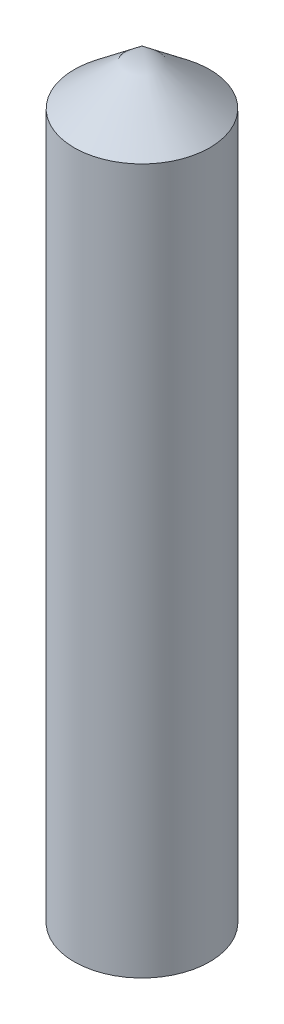
ISO-10303-21;
HEADER;
FILE_DESCRIPTION(('STEP AP214'),'2;1');
FILE_NAME('part.step','',(''),(''),'','','');
FILE_SCHEMA(('AUTOMOTIVE_DESIGN { 1 0 10303 214 1 1 1 1 }'));
ENDSEC;
DATA;
#1=APPLICATION_CONTEXT('core data for automotive mechanical design processes');
#2=APPLICATION_PROTOCOL_DEFINITION('international standard','automotive_design',2000,#1);
#3=PRODUCT_CONTEXT('',#1,'mechanical');
#4=PRODUCT('Part','Part','',(#3));
#5=PRODUCT_RELATED_PRODUCT_CATEGORY('part','',(#4));
#6=PRODUCT_DEFINITION_FORMATION('','',#4);
#7=PRODUCT_DEFINITION_CONTEXT('part definition',#1,'design');
#8=PRODUCT_DEFINITION('design','',#6,#7);
#9=PRODUCT_DEFINITION_SHAPE('','',#8);
#10=(LENGTH_UNIT() NAMED_UNIT(*) SI_UNIT(.MILLI.,.METRE.));
#11=(NAMED_UNIT(*) PLANE_ANGLE_UNIT() SI_UNIT($,.RADIAN.));
#12=(NAMED_UNIT(*) SI_UNIT($,.STERADIAN.) SOLID_ANGLE_UNIT());
#13=UNCERTAINTY_MEASURE_WITH_UNIT(LENGTH_MEASURE(1.E-05),#10,'distance_accuracy_value','');
#14=(GEOMETRIC_REPRESENTATION_CONTEXT(3) GLOBAL_UNCERTAINTY_ASSIGNED_CONTEXT((#13)) GLOBAL_UNIT_ASSIGNED_CONTEXT((#10,
#11,#12)) REPRESENTATION_CONTEXT('',''));
#15=CARTESIAN_POINT('',(0.,0.,0.));
#16=DIRECTION('',(0.,0.,1.));
#17=DIRECTION('',(1.,0.,0.));
#18=AXIS2_PLACEMENT_3D('',#15,#16,#17);
#19=CARTESIAN_POINT('',(0.,130.,0.));
#20=DIRECTION('',(0.,-1.,0.));
#21=DIRECTION('',(0.,0.,-1.));
#22=AXIS2_PLACEMENT_3D('',#19,#20,#21);
#23=CYLINDRICAL_SURFACE('',#22,12.5);
#24=CARTESIAN_POINT('',(0.,130.,0.));
#25=DIRECTION('',(0.,1.,0.));
#26=DIRECTION('',(0.,0.,1.));
#27=AXIS2_PLACEMENT_3D('',#24,#25,#26);
#28=CIRCLE('',#27,12.5);
#29=CARTESIAN_POINT('',(0.,130.,12.5));
#30=VERTEX_POINT('',#29);
#31=EDGE_CURVE('E11',#30,#30,#28,.T.);
#32=ORIENTED_EDGE('',*,*,#31,.F.);
#33=EDGE_LOOP('',(#32));
#34=FACE_BOUND('',#33,.T.);
#35=CARTESIAN_POINT('',(0.,0.,0.));
#36=DIRECTION('',(0.,1.,0.));
#37=DIRECTION('',(0.,0.,1.));
#38=AXIS2_PLACEMENT_3D('',#35,#36,#37);
#39=CIRCLE('',#38,12.5);
#40=CARTESIAN_POINT('',(0.,0.,12.5));
#41=VERTEX_POINT('',#40);
#42=EDGE_CURVE('E37',#41,#41,#39,.T.);
#43=ORIENTED_EDGE('',*,*,#42,.T.);
#44=EDGE_LOOP('',(#43));
#45=FACE_BOUND('',#44,.T.);
#46=ADVANCED_FACE('F34',(#34,#45),#23,.T.);
#47=CARTESIAN_POINT('',(0.,0.,0.));
#48=DIRECTION('',(0.,1.,0.));
#49=DIRECTION('',(0.,0.,1.));
#50=AXIS2_PLACEMENT_3D('',#47,#48,#49);
#51=PLANE('',#50);
#52=ORIENTED_EDGE('',*,*,#42,.F.);
#53=EDGE_LOOP('',(#52));
#54=FACE_BOUND('',#53,.T.);
#55=ADVANCED_FACE('F45',(#54),#51,.F.);
#56=CARTESIAN_POINT('',(0.,140.,0.));
#57=DIRECTION('',(0.,-1.,0.));
#58=DIRECTION('',(1.,0.,0.));
#59=AXIS2_PLACEMENT_3D('',#56,#57,#58);
#60=CONICAL_SURFACE('',#59,0.,0.896055384571344);
#61=ORIENTED_EDGE('',*,*,#31,.T.);
#62=EDGE_LOOP('',(#61));
#63=FACE_BOUND('',#62,.T.);
#64=CARTESIAN_POINT('',(0.,140.,0.));
#65=VERTEX_POINT('',#64);
#66=VERTEX_LOOP('',#65);
#67=FACE_BOUND('',#66,.T.);
#68=ADVANCED_FACE('F43',(#63,#67),#60,.T.);
#69=CLOSED_SHELL('',(#46,#55,#68));
#70=MANIFOLD_SOLID_BREP('B2',#69);
#71=ADVANCED_BREP_SHAPE_REPRESENTATION('',(#18,#70),#14);
#72=SHAPE_DEFINITION_REPRESENTATION(#9,#71);
ENDSEC;
END-ISO-10303-21;
